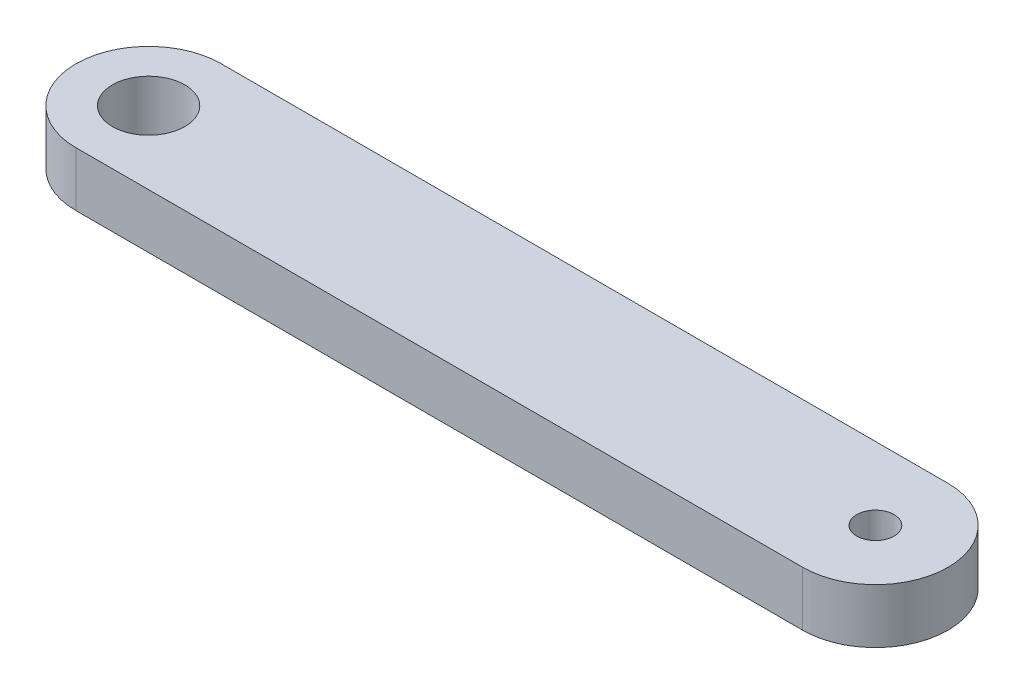
ISO-10303-21;
HEADER;
FILE_DESCRIPTION(('STEP AP214'),'2;1');
FILE_NAME('part.step','',(''),(''),'','','');
FILE_SCHEMA(('AUTOMOTIVE_DESIGN { 1 0 10303 214 1 1 1 1 }'));
ENDSEC;
DATA;
#1=APPLICATION_CONTEXT('core data for automotive mechanical design processes');
#2=APPLICATION_PROTOCOL_DEFINITION('international standard','automotive_design',2000,#1);
#3=PRODUCT_CONTEXT('',#1,'mechanical');
#4=PRODUCT('Part','Part','',(#3));
#5=PRODUCT_RELATED_PRODUCT_CATEGORY('part','',(#4));
#6=PRODUCT_DEFINITION_FORMATION('','',#4);
#7=PRODUCT_DEFINITION_CONTEXT('part definition',#1,'design');
#8=PRODUCT_DEFINITION('design','',#6,#7);
#9=PRODUCT_DEFINITION_SHAPE('','',#8);
#10=(LENGTH_UNIT() NAMED_UNIT(*) SI_UNIT(.MILLI.,.METRE.));
#11=(NAMED_UNIT(*) PLANE_ANGLE_UNIT() SI_UNIT($,.RADIAN.));
#12=(NAMED_UNIT(*) SI_UNIT($,.STERADIAN.) SOLID_ANGLE_UNIT());
#13=UNCERTAINTY_MEASURE_WITH_UNIT(LENGTH_MEASURE(1.E-05),#10,'distance_accuracy_value','');
#14=(GEOMETRIC_REPRESENTATION_CONTEXT(3) GLOBAL_UNCERTAINTY_ASSIGNED_CONTEXT((#13)) GLOBAL_UNIT_ASSIGNED_CONTEXT((#10,
#11,#12)) REPRESENTATION_CONTEXT('',''));
#15=CARTESIAN_POINT('',(0.,0.,0.));
#16=DIRECTION('',(0.,0.,1.));
#17=DIRECTION('',(1.,0.,0.));
#18=AXIS2_PLACEMENT_3D('',#15,#16,#17);
#19=CARTESIAN_POINT('',(0.,4.7625,6.35));
#20=DIRECTION('',(0.,0.,-1.));
#21=DIRECTION('',(-1.,0.,0.));
#22=AXIS2_PLACEMENT_3D('',#19,#20,#21);
#23=PLANE('',#22);
#24=DIRECTION('',(1.,0.,0.));
#25=VECTOR('',#24,1.);
#26=CARTESIAN_POINT('',(0.,0.,6.35));
#27=LINE('',#26,#25);
#28=CARTESIAN_POINT('',(-63.5,0.,6.35));
#29=VERTEX_POINT('',#28);
#30=CARTESIAN_POINT('',(0.,0.,6.35));
#31=VERTEX_POINT('',#30);
#32=EDGE_CURVE('E115',#29,#31,#27,.T.);
#33=ORIENTED_EDGE('',*,*,#32,.T.);
#34=DIRECTION('',(0.,-1.,0.));
#35=VECTOR('',#34,1.);
#36=CARTESIAN_POINT('',(0.,4.7625,6.35));
#37=LINE('',#36,#35);
#38=CARTESIAN_POINT('',(0.,4.7625,6.35));
#39=VERTEX_POINT('',#38);
#40=EDGE_CURVE('E13',#39,#31,#37,.T.);
#41=ORIENTED_EDGE('',*,*,#40,.F.);
#42=DIRECTION('',(1.,0.,0.));
#43=VECTOR('',#42,1.);
#44=CARTESIAN_POINT('',(0.,4.7625,6.35));
#45=LINE('',#44,#43);
#46=CARTESIAN_POINT('',(-63.5,4.7625,6.35));
#47=VERTEX_POINT('',#46);
#48=EDGE_CURVE('E100',#47,#39,#45,.T.);
#49=ORIENTED_EDGE('',*,*,#48,.F.);
#50=DIRECTION('',(0.,-1.,0.));
#51=VECTOR('',#50,1.);
#52=CARTESIAN_POINT('',(-63.5,4.7625,6.35));
#53=LINE('',#52,#51);
#54=EDGE_CURVE('E111',#47,#29,#53,.T.);
#55=ORIENTED_EDGE('',*,*,#54,.T.);
#56=EDGE_LOOP('',(#33,#41,#49,#55));
#57=FACE_BOUND('',#56,.T.);
#58=ADVANCED_FACE('F53',(#57),#23,.F.);
#59=CARTESIAN_POINT('',(0.,4.7625,0.));
#60=DIRECTION('',(0.,-1.,0.));
#61=DIRECTION('',(0.,0.,-1.));
#62=AXIS2_PLACEMENT_3D('',#59,#60,#61);
#63=CYLINDRICAL_SURFACE('',#62,6.35);
#64=CARTESIAN_POINT('',(0.,0.,0.));
#65=DIRECTION('',(0.,1.,0.));
#66=DIRECTION('',(0.,0.,1.));
#67=AXIS2_PLACEMENT_3D('',#64,#65,#66);
#68=CIRCLE('',#67,6.35);
#69=CARTESIAN_POINT('',(0.,0.,-6.35));
#70=VERTEX_POINT('',#69);
#71=EDGE_CURVE('E105',#31,#70,#68,.T.);
#72=ORIENTED_EDGE('',*,*,#71,.T.);
#73=DIRECTION('',(0.,-1.,0.));
#74=VECTOR('',#73,1.);
#75=CARTESIAN_POINT('',(0.,4.7625,-6.35));
#76=LINE('',#75,#74);
#77=CARTESIAN_POINT('',(0.,4.7625,-6.35));
#78=VERTEX_POINT('',#77);
#79=EDGE_CURVE('E61',#78,#70,#76,.T.);
#80=ORIENTED_EDGE('',*,*,#79,.F.);
#81=CARTESIAN_POINT('',(0.,4.7625,0.));
#82=DIRECTION('',(0.,1.,0.));
#83=DIRECTION('',(0.,0.,1.));
#84=AXIS2_PLACEMENT_3D('',#81,#82,#83);
#85=CIRCLE('',#84,6.35);
#86=EDGE_CURVE('E95',#39,#78,#85,.T.);
#87=ORIENTED_EDGE('',*,*,#86,.F.);
#88=ORIENTED_EDGE('',*,*,#40,.T.);
#89=EDGE_LOOP('',(#72,#80,#87,#88));
#90=FACE_BOUND('',#89,.T.);
#91=ADVANCED_FACE('F104',(#90),#63,.T.);
#92=CARTESIAN_POINT('',(0.,4.7625,-6.35));
#93=DIRECTION('',(0.,0.,-1.));
#94=DIRECTION('',(-1.,0.,0.));
#95=AXIS2_PLACEMENT_3D('',#92,#93,#94);
#96=PLANE('',#95);
#97=DIRECTION('',(1.,0.,0.));
#98=VECTOR('',#97,1.);
#99=CARTESIAN_POINT('',(0.,0.,-6.35));
#100=LINE('',#99,#98);
#101=CARTESIAN_POINT('',(-63.5,0.,-6.35));
#102=VERTEX_POINT('',#101);
#103=EDGE_CURVE('E120',#102,#70,#100,.T.);
#104=ORIENTED_EDGE('',*,*,#103,.F.);
#105=DIRECTION('',(0.,-1.,0.));
#106=VECTOR('',#105,1.);
#107=CARTESIAN_POINT('',(-63.5,4.7625,-6.35));
#108=LINE('',#107,#106);
#109=CARTESIAN_POINT('',(-63.5,4.7625,-6.35));
#110=VERTEX_POINT('',#109);
#111=EDGE_CURVE('E85',#110,#102,#108,.T.);
#112=ORIENTED_EDGE('',*,*,#111,.F.);
#113=DIRECTION('',(1.,0.,0.));
#114=VECTOR('',#113,1.);
#115=CARTESIAN_POINT('',(0.,4.7625,-6.35));
#116=LINE('',#115,#114);
#117=EDGE_CURVE('E98',#110,#78,#116,.T.);
#118=ORIENTED_EDGE('',*,*,#117,.T.);
#119=ORIENTED_EDGE('',*,*,#79,.T.);
#120=EDGE_LOOP('',(#104,#112,#118,#119));
#121=FACE_BOUND('',#120,.T.);
#122=ADVANCED_FACE('F109',(#121),#96,.T.);
#123=CARTESIAN_POINT('',(-63.5,4.7625,0.));
#124=DIRECTION('',(0.,-1.,0.));
#125=DIRECTION('',(0.,0.,-1.));
#126=AXIS2_PLACEMENT_3D('',#123,#124,#125);
#127=CYLINDRICAL_SURFACE('',#126,6.35);
#128=CARTESIAN_POINT('',(-63.5,0.,0.));
#129=DIRECTION('',(0.,1.,0.));
#130=DIRECTION('',(0.,0.,1.));
#131=AXIS2_PLACEMENT_3D('',#128,#129,#130);
#132=CIRCLE('',#131,6.35);
#133=EDGE_CURVE('E88',#102,#29,#132,.T.);
#134=ORIENTED_EDGE('',*,*,#133,.T.);
#135=ORIENTED_EDGE('',*,*,#54,.F.);
#136=CARTESIAN_POINT('',(-63.5,4.7625,0.));
#137=DIRECTION('',(0.,1.,0.));
#138=DIRECTION('',(0.,0.,1.));
#139=AXIS2_PLACEMENT_3D('',#136,#137,#138);
#140=CIRCLE('',#139,6.35);
#141=EDGE_CURVE('E69',#110,#47,#140,.T.);
#142=ORIENTED_EDGE('',*,*,#141,.F.);
#143=ORIENTED_EDGE('',*,*,#111,.T.);
#144=EDGE_LOOP('',(#134,#135,#142,#143));
#145=FACE_BOUND('',#144,.T.);
#146=ADVANCED_FACE('F139',(#145),#127,.T.);
#147=CARTESIAN_POINT('',(0.,4.7625,0.));
#148=DIRECTION('',(0.,1.,0.));
#149=DIRECTION('',(0.,0.,1.));
#150=AXIS2_PLACEMENT_3D('',#147,#148,#149);
#151=PLANE('',#150);
#152=CARTESIAN_POINT('',(-63.5,4.7625,0.));
#153=DIRECTION('',(0.,1.,0.));
#154=DIRECTION('',(0.,0.,1.));
#155=AXIS2_PLACEMENT_3D('',#152,#153,#154);
#156=CIRCLE('',#155,3.1623);
#157=CARTESIAN_POINT('',(-63.5,4.7625,3.1623));
#158=VERTEX_POINT('',#157);
#159=EDGE_CURVE('E190',#158,#158,#156,.T.);
#160=ORIENTED_EDGE('',*,*,#159,.F.);
#161=EDGE_LOOP('',(#160));
#162=FACE_BOUND('',#161,.T.);
#163=CARTESIAN_POINT('',(0.,4.7625,0.));
#164=DIRECTION('',(0.,1.,0.));
#165=DIRECTION('',(0.,0.,1.));
#166=AXIS2_PLACEMENT_3D('',#163,#164,#165);
#167=CIRCLE('',#166,1.63195);
#168=CARTESIAN_POINT('',(0.,4.7625,1.63195));
#169=VERTEX_POINT('',#168);
#170=EDGE_CURVE('E192',#169,#169,#167,.T.);
#171=ORIENTED_EDGE('',*,*,#170,.F.);
#172=EDGE_LOOP('',(#171));
#173=FACE_BOUND('',#172,.T.);
#174=ORIENTED_EDGE('',*,*,#48,.T.);
#175=ORIENTED_EDGE('',*,*,#86,.T.);
#176=ORIENTED_EDGE('',*,*,#117,.F.);
#177=ORIENTED_EDGE('',*,*,#141,.T.);
#178=EDGE_LOOP('',(#174,#175,#176,#177));
#179=FACE_BOUND('',#178,.T.);
#180=ADVANCED_FACE('F96',(#162,#173,#179),#151,.T.);
#181=CARTESIAN_POINT('',(0.,0.,0.));
#182=DIRECTION('',(0.,1.,0.));
#183=DIRECTION('',(0.,0.,1.));
#184=AXIS2_PLACEMENT_3D('',#181,#182,#183);
#185=PLANE('',#184);
#186=CARTESIAN_POINT('',(-63.5,0.,0.));
#187=DIRECTION('',(0.,1.,0.));
#188=DIRECTION('',(0.,0.,1.));
#189=AXIS2_PLACEMENT_3D('',#186,#187,#188);
#190=CIRCLE('',#189,3.1623);
#191=CARTESIAN_POINT('',(-63.5,0.,3.1623));
#192=VERTEX_POINT('',#191);
#193=EDGE_CURVE('E187',#192,#192,#190,.T.);
#194=ORIENTED_EDGE('',*,*,#193,.T.);
#195=EDGE_LOOP('',(#194));
#196=FACE_BOUND('',#195,.T.);
#197=CARTESIAN_POINT('',(0.,0.,0.));
#198=DIRECTION('',(0.,1.,0.));
#199=DIRECTION('',(0.,0.,1.));
#200=AXIS2_PLACEMENT_3D('',#197,#198,#199);
#201=CIRCLE('',#200,1.63195);
#202=CARTESIAN_POINT('',(0.,0.,1.63195));
#203=VERTEX_POINT('',#202);
#204=EDGE_CURVE('E118',#203,#203,#201,.T.);
#205=ORIENTED_EDGE('',*,*,#204,.T.);
#206=EDGE_LOOP('',(#205));
#207=FACE_BOUND('',#206,.T.);
#208=ORIENTED_EDGE('',*,*,#32,.F.);
#209=ORIENTED_EDGE('',*,*,#133,.F.);
#210=ORIENTED_EDGE('',*,*,#103,.T.);
#211=ORIENTED_EDGE('',*,*,#71,.F.);
#212=EDGE_LOOP('',(#208,#209,#210,#211));
#213=FACE_BOUND('',#212,.T.);
#214=ADVANCED_FACE('F127',(#196,#207,#213),#185,.F.);
#215=CARTESIAN_POINT('',(0.,4.7625,0.));
#216=DIRECTION('',(0.,1.,0.));
#217=DIRECTION('',(0.,0.,1.));
#218=AXIS2_PLACEMENT_3D('',#215,#216,#217);
#219=CYLINDRICAL_SURFACE('',#218,1.63195);
#220=ORIENTED_EDGE('',*,*,#204,.F.);
#221=EDGE_LOOP('',(#220));
#222=FACE_BOUND('',#221,.T.);
#223=ORIENTED_EDGE('',*,*,#170,.T.);
#224=EDGE_LOOP('',(#223));
#225=FACE_BOUND('',#224,.T.);
#226=ADVANCED_FACE('F129',(#222,#225),#219,.F.);
#227=CARTESIAN_POINT('',(-63.5,0.,0.));
#228=DIRECTION('',(0.,1.,0.));
#229=DIRECTION('',(0.,0.,1.));
#230=AXIS2_PLACEMENT_3D('',#227,#228,#229);
#231=CYLINDRICAL_SURFACE('',#230,3.1623);
#232=ORIENTED_EDGE('',*,*,#193,.F.);
#233=EDGE_LOOP('',(#232));
#234=FACE_BOUND('',#233,.T.);
#235=ORIENTED_EDGE('',*,*,#159,.T.);
#236=EDGE_LOOP('',(#235));
#237=FACE_BOUND('',#236,.T.);
#238=ADVANCED_FACE('F136',(#234,#237),#231,.F.);
#239=CLOSED_SHELL('',(#58,#91,#122,#146,#180,#214,#226,#238));
#240=MANIFOLD_SOLID_BREP('B2',#239);
#241=ADVANCED_BREP_SHAPE_REPRESENTATION('',(#18,#240),#14);
#242=SHAPE_DEFINITION_REPRESENTATION(#9,#241);
ENDSEC;
END-ISO-10303-21;
